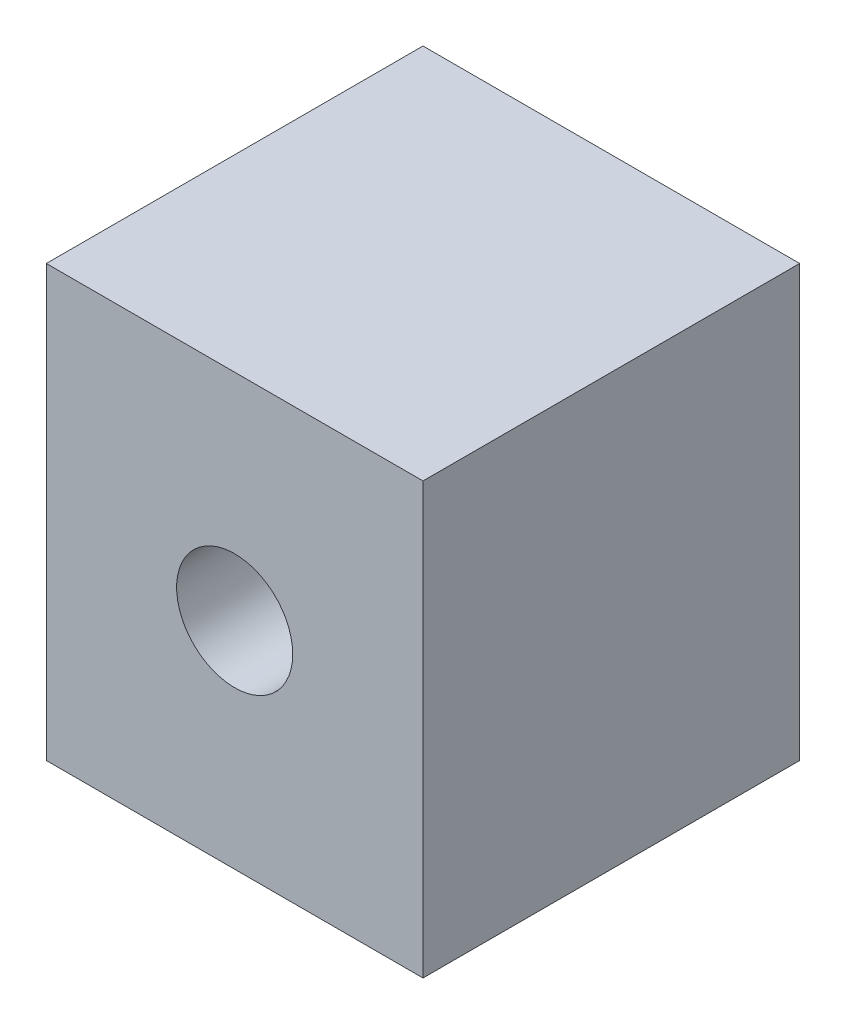
ISO-10303-21;
HEADER;
FILE_DESCRIPTION(('STEP AP214'),'2;1');
FILE_NAME('part.step','',(''),(''),'','','');
FILE_SCHEMA(('AUTOMOTIVE_DESIGN { 1 0 10303 214 1 1 1 1 }'));
ENDSEC;
DATA;
#1=APPLICATION_CONTEXT('core data for automotive mechanical design processes');
#2=APPLICATION_PROTOCOL_DEFINITION('international standard','automotive_design',2000,#1);
#3=PRODUCT_CONTEXT('',#1,'mechanical');
#4=PRODUCT('Part','Part','',(#3));
#5=PRODUCT_RELATED_PRODUCT_CATEGORY('part','',(#4));
#6=PRODUCT_DEFINITION_FORMATION('','',#4);
#7=PRODUCT_DEFINITION_CONTEXT('part definition',#1,'design');
#8=PRODUCT_DEFINITION('design','',#6,#7);
#9=PRODUCT_DEFINITION_SHAPE('','',#8);
#10=(LENGTH_UNIT() NAMED_UNIT(*) SI_UNIT(.MILLI.,.METRE.));
#11=(NAMED_UNIT(*) PLANE_ANGLE_UNIT() SI_UNIT($,.RADIAN.));
#12=(NAMED_UNIT(*) SI_UNIT($,.STERADIAN.) SOLID_ANGLE_UNIT());
#13=UNCERTAINTY_MEASURE_WITH_UNIT(LENGTH_MEASURE(1.E-05),#10,'distance_accuracy_value','');
#14=(GEOMETRIC_REPRESENTATION_CONTEXT(3) GLOBAL_UNCERTAINTY_ASSIGNED_CONTEXT((#13)) GLOBAL_UNIT_ASSIGNED_CONTEXT((#10,
#11,#12)) REPRESENTATION_CONTEXT('',''));
#15=CARTESIAN_POINT('',(0.,0.,0.));
#16=DIRECTION('',(0.,0.,1.));
#17=DIRECTION('',(1.,0.,0.));
#18=AXIS2_PLACEMENT_3D('',#15,#16,#17);
#19=CARTESIAN_POINT('',(0.,50.8,0.));
#20=DIRECTION('',(1.,0.,0.));
#21=DIRECTION('',(0.,0.,-1.));
#22=AXIS2_PLACEMENT_3D('',#19,#20,#21);
#23=PLANE('',#22);
#24=DIRECTION('',(0.,0.,1.));
#25=VECTOR('',#24,1.);
#26=CARTESIAN_POINT('',(0.,0.,0.));
#27=LINE('',#26,#25);
#28=CARTESIAN_POINT('',(0.,0.,0.));
#29=VERTEX_POINT('',#28);
#30=CARTESIAN_POINT('',(0.,0.,44.45));
#31=VERTEX_POINT('',#30);
#32=EDGE_CURVE('E100',#29,#31,#27,.T.);
#33=ORIENTED_EDGE('',*,*,#32,.T.);
#34=DIRECTION('',(0.,-1.,0.));
#35=VECTOR('',#34,1.);
#36=CARTESIAN_POINT('',(0.,50.8,44.45));
#37=LINE('',#36,#35);
#38=CARTESIAN_POINT('',(0.,50.8,44.45));
#39=VERTEX_POINT('',#38);
#40=EDGE_CURVE('E11',#39,#31,#37,.T.);
#41=ORIENTED_EDGE('',*,*,#40,.F.);
#42=DIRECTION('',(0.,0.,1.));
#43=VECTOR('',#42,1.);
#44=CARTESIAN_POINT('',(0.,50.8,0.));
#45=LINE('',#44,#43);
#46=CARTESIAN_POINT('',(0.,50.8,0.));
#47=VERTEX_POINT('',#46);
#48=EDGE_CURVE('E87',#47,#39,#45,.T.);
#49=ORIENTED_EDGE('',*,*,#48,.F.);
#50=DIRECTION('',(0.,-1.,0.));
#51=VECTOR('',#50,1.);
#52=CARTESIAN_POINT('',(0.,50.8,0.));
#53=LINE('',#52,#51);
#54=EDGE_CURVE('E96',#47,#29,#53,.T.);
#55=ORIENTED_EDGE('',*,*,#54,.T.);
#56=EDGE_LOOP('',(#33,#41,#49,#55));
#57=FACE_BOUND('',#56,.T.);
#58=ADVANCED_FACE('F35',(#57),#23,.F.);
#59=CARTESIAN_POINT('',(0.,50.8,44.45));
#60=DIRECTION('',(0.,0.,-1.));
#61=DIRECTION('',(-1.,0.,0.));
#62=AXIS2_PLACEMENT_3D('',#59,#60,#61);
#63=PLANE('',#62);
#64=CARTESIAN_POINT('',(22.225,25.4,44.45));
#65=DIRECTION('',(0.,0.,1.));
#66=DIRECTION('',(1.,0.,0.));
#67=AXIS2_PLACEMENT_3D('',#64,#65,#66);
#68=CIRCLE('',#67,6.849999);
#69=CARTESIAN_POINT('',(29.074999,25.4,44.45));
#70=VERTEX_POINT('',#69);
#71=EDGE_CURVE('E113',#70,#70,#68,.T.);
#72=ORIENTED_EDGE('',*,*,#71,.F.);
#73=EDGE_LOOP('',(#72));
#74=FACE_BOUND('',#73,.T.);
#75=DIRECTION('',(1.,0.,0.));
#76=VECTOR('',#75,1.);
#77=CARTESIAN_POINT('',(0.,0.,44.45));
#78=LINE('',#77,#76);
#79=CARTESIAN_POINT('',(44.45,0.,44.45));
#80=VERTEX_POINT('',#79);
#81=EDGE_CURVE('E91',#31,#80,#78,.T.);
#82=ORIENTED_EDGE('',*,*,#81,.T.);
#83=DIRECTION('',(0.,-1.,0.));
#84=VECTOR('',#83,1.);
#85=CARTESIAN_POINT('',(44.45,50.8,44.45));
#86=LINE('',#85,#84);
#87=CARTESIAN_POINT('',(44.45,50.8,44.45));
#88=VERTEX_POINT('',#87);
#89=EDGE_CURVE('E44',#88,#80,#86,.T.);
#90=ORIENTED_EDGE('',*,*,#89,.F.);
#91=DIRECTION('',(1.,0.,0.));
#92=VECTOR('',#91,1.);
#93=CARTESIAN_POINT('',(0.,50.8,44.45));
#94=LINE('',#93,#92);
#95=EDGE_CURVE('E82',#39,#88,#94,.T.);
#96=ORIENTED_EDGE('',*,*,#95,.F.);
#97=ORIENTED_EDGE('',*,*,#40,.T.);
#98=EDGE_LOOP('',(#82,#90,#96,#97));
#99=FACE_BOUND('',#98,.T.);
#100=ADVANCED_FACE('F90',(#74,#99),#63,.F.);
#101=CARTESIAN_POINT('',(44.45,50.8,0.));
#102=DIRECTION('',(-1.,0.,0.));
#103=DIRECTION('',(0.,0.,1.));
#104=AXIS2_PLACEMENT_3D('',#101,#102,#103);
#105=PLANE('',#104);
#106=DIRECTION('',(0.,0.,-1.));
#107=VECTOR('',#106,1.);
#108=CARTESIAN_POINT('',(44.45,0.,0.));
#109=LINE('',#108,#107);
#110=CARTESIAN_POINT('',(44.45,0.,0.));
#111=VERTEX_POINT('',#110);
#112=EDGE_CURVE('E69',#80,#111,#109,.T.);
#113=ORIENTED_EDGE('',*,*,#112,.T.);
#114=DIRECTION('',(0.,-1.,0.));
#115=VECTOR('',#114,1.);
#116=CARTESIAN_POINT('',(44.45,50.8,0.));
#117=LINE('',#116,#115);
#118=CARTESIAN_POINT('',(44.45,50.8,0.));
#119=VERTEX_POINT('',#118);
#120=EDGE_CURVE('E92',#119,#111,#117,.T.);
#121=ORIENTED_EDGE('',*,*,#120,.F.);
#122=DIRECTION('',(0.,0.,-1.));
#123=VECTOR('',#122,1.);
#124=CARTESIAN_POINT('',(44.45,50.8,0.));
#125=LINE('',#124,#123);
#126=EDGE_CURVE('E85',#88,#119,#125,.T.);
#127=ORIENTED_EDGE('',*,*,#126,.F.);
#128=ORIENTED_EDGE('',*,*,#89,.T.);
#129=EDGE_LOOP('',(#113,#121,#127,#128));
#130=FACE_BOUND('',#129,.T.);
#131=ADVANCED_FACE('F94',(#130),#105,.F.);
#132=CARTESIAN_POINT('',(0.,50.8,0.));
#133=DIRECTION('',(0.,0.,1.));
#134=DIRECTION('',(1.,0.,0.));
#135=AXIS2_PLACEMENT_3D('',#132,#133,#134);
#136=PLANE('',#135);
#137=CARTESIAN_POINT('',(22.225,25.4,0.));
#138=DIRECTION('',(0.,0.,1.));
#139=DIRECTION('',(1.,0.,0.));
#140=AXIS2_PLACEMENT_3D('',#137,#138,#139);
#141=CIRCLE('',#140,6.849999);
#142=CARTESIAN_POINT('',(29.074999,25.4,0.));
#143=VERTEX_POINT('',#142);
#144=EDGE_CURVE('E38',#143,#143,#141,.T.);
#145=ORIENTED_EDGE('',*,*,#144,.T.);
#146=EDGE_LOOP('',(#145));
#147=FACE_BOUND('',#146,.T.);
#148=DIRECTION('',(-1.,0.,0.));
#149=VECTOR('',#148,1.);
#150=CARTESIAN_POINT('',(0.,0.,0.));
#151=LINE('',#150,#149);
#152=EDGE_CURVE('E75',#111,#29,#151,.T.);
#153=ORIENTED_EDGE('',*,*,#152,.T.);
#154=ORIENTED_EDGE('',*,*,#54,.F.);
#155=DIRECTION('',(-1.,0.,0.));
#156=VECTOR('',#155,1.);
#157=CARTESIAN_POINT('',(0.,50.8,0.));
#158=LINE('',#157,#156);
#159=EDGE_CURVE('E52',#119,#47,#158,.T.);
#160=ORIENTED_EDGE('',*,*,#159,.F.);
#161=ORIENTED_EDGE('',*,*,#120,.T.);
#162=EDGE_LOOP('',(#153,#154,#160,#161));
#163=FACE_BOUND('',#162,.T.);
#164=ADVANCED_FACE('F107',(#147,#163),#136,.F.);
#165=CARTESIAN_POINT('',(0.,50.8,0.));
#166=DIRECTION('',(0.,1.,0.));
#167=DIRECTION('',(0.,0.,1.));
#168=AXIS2_PLACEMENT_3D('',#165,#166,#167);
#169=PLANE('',#168);
#170=ORIENTED_EDGE('',*,*,#48,.T.);
#171=ORIENTED_EDGE('',*,*,#95,.T.);
#172=ORIENTED_EDGE('',*,*,#126,.T.);
#173=ORIENTED_EDGE('',*,*,#159,.T.);
#174=EDGE_LOOP('',(#170,#171,#172,#173));
#175=FACE_BOUND('',#174,.T.);
#176=ADVANCED_FACE('F83',(#175),#169,.T.);
#177=CARTESIAN_POINT('',(0.,0.,0.));
#178=DIRECTION('',(0.,1.,0.));
#179=DIRECTION('',(0.,0.,1.));
#180=AXIS2_PLACEMENT_3D('',#177,#178,#179);
#181=PLANE('',#180);
#182=CARTESIAN_POINT('',(33.401,0.,22.225));
#183=DIRECTION('',(0.,-1.,0.));
#184=DIRECTION('',(0.,0.,-1.));
#185=AXIS2_PLACEMENT_3D('',#182,#183,#184);
#186=CIRCLE('',#185,3.674999);
#187=CARTESIAN_POINT('',(33.401,0.,18.550001));
#188=VERTEX_POINT('',#187);
#189=EDGE_CURVE('E123',#188,#188,#186,.T.);
#190=ORIENTED_EDGE('',*,*,#189,.F.);
#191=EDGE_LOOP('',(#190));
#192=FACE_BOUND('',#191,.T.);
#193=CARTESIAN_POINT('',(11.0818452898828,0.,22.225));
#194=DIRECTION('',(0.,-1.,0.));
#195=DIRECTION('',(0.,0.,-1.));
#196=AXIS2_PLACEMENT_3D('',#193,#194,#195);
#197=CIRCLE('',#196,3.674999);
#198=CARTESIAN_POINT('',(11.0818452898828,0.,18.550001));
#199=VERTEX_POINT('',#198);
#200=EDGE_CURVE('E117',#199,#199,#197,.T.);
#201=ORIENTED_EDGE('',*,*,#200,.F.);
#202=EDGE_LOOP('',(#201));
#203=FACE_BOUND('',#202,.T.);
#204=ORIENTED_EDGE('',*,*,#32,.F.);
#205=ORIENTED_EDGE('',*,*,#152,.F.);
#206=ORIENTED_EDGE('',*,*,#112,.F.);
#207=ORIENTED_EDGE('',*,*,#81,.F.);
#208=EDGE_LOOP('',(#204,#205,#206,#207));
#209=FACE_BOUND('',#208,.T.);
#210=ADVANCED_FACE('F110',(#192,#203,#209),#181,.F.);
#211=CARTESIAN_POINT('',(22.225,25.4,-6.35));
#212=DIRECTION('',(0.,0.,1.));
#213=DIRECTION('',(1.,0.,0.));
#214=AXIS2_PLACEMENT_3D('',#211,#212,#213);
#215=CYLINDRICAL_SURFACE('',#214,6.849999);
#216=ORIENTED_EDGE('',*,*,#71,.T.);
#217=EDGE_LOOP('',(#216));
#218=FACE_BOUND('',#217,.T.);
#219=ORIENTED_EDGE('',*,*,#144,.F.);
#220=EDGE_LOOP('',(#219));
#221=FACE_BOUND('',#220,.T.);
#222=ADVANCED_FACE('F140',(#218,#221),#215,.F.);
#223=CARTESIAN_POINT('',(11.0818452898828,6.35,22.225));
#224=DIRECTION('',(0.,-1.,0.));
#225=DIRECTION('',(0.,0.,-1.));
#226=AXIS2_PLACEMENT_3D('',#223,#224,#225);
#227=CYLINDRICAL_SURFACE('',#226,3.674999);
#228=CARTESIAN_POINT('',(11.0818452898828,6.35,22.225));
#229=DIRECTION('',(0.,-1.,0.));
#230=DIRECTION('',(0.,0.,-1.));
#231=AXIS2_PLACEMENT_3D('',#228,#229,#230);
#232=CIRCLE('',#231,3.674999);
#233=CARTESIAN_POINT('',(11.0818452898828,6.35,18.550001));
#234=VERTEX_POINT('',#233);
#235=EDGE_CURVE('E116',#234,#234,#232,.T.);
#236=ORIENTED_EDGE('',*,*,#235,.F.);
#237=EDGE_LOOP('',(#236));
#238=FACE_BOUND('',#237,.T.);
#239=ORIENTED_EDGE('',*,*,#200,.T.);
#240=EDGE_LOOP('',(#239));
#241=FACE_BOUND('',#240,.T.);
#242=ADVANCED_FACE('F144',(#238,#241),#227,.F.);
#243=CARTESIAN_POINT('',(11.0818452898828,6.35,22.225));
#244=DIRECTION('',(0.,-1.,0.));
#245=DIRECTION('',(0.,0.,-1.));
#246=AXIS2_PLACEMENT_3D('',#243,#244,#245);
#247=PLANE('',#246);
#248=ORIENTED_EDGE('',*,*,#235,.T.);
#249=EDGE_LOOP('',(#248));
#250=FACE_BOUND('',#249,.T.);
#251=ADVANCED_FACE('F134',(#250),#247,.T.);
#252=CARTESIAN_POINT('',(33.401,6.35,22.225));
#253=DIRECTION('',(0.,-1.,0.));
#254=DIRECTION('',(0.,0.,-1.));
#255=AXIS2_PLACEMENT_3D('',#252,#253,#254);
#256=CYLINDRICAL_SURFACE('',#255,3.674999);
#257=CARTESIAN_POINT('',(33.401,6.35,22.225));
#258=DIRECTION('',(0.,-1.,0.));
#259=DIRECTION('',(0.,0.,-1.));
#260=AXIS2_PLACEMENT_3D('',#257,#258,#259);
#261=CIRCLE('',#260,3.674999);
#262=CARTESIAN_POINT('',(33.401,6.35,18.550001));
#263=VERTEX_POINT('',#262);
#264=EDGE_CURVE('E120',#263,#263,#261,.T.);
#265=ORIENTED_EDGE('',*,*,#264,.F.);
#266=EDGE_LOOP('',(#265));
#267=FACE_BOUND('',#266,.T.);
#268=ORIENTED_EDGE('',*,*,#189,.T.);
#269=EDGE_LOOP('',(#268));
#270=FACE_BOUND('',#269,.T.);
#271=ADVANCED_FACE('F131',(#267,#270),#256,.F.);
#272=CARTESIAN_POINT('',(33.401,6.35,22.225));
#273=DIRECTION('',(0.,-1.,0.));
#274=DIRECTION('',(0.,0.,-1.));
#275=AXIS2_PLACEMENT_3D('',#272,#273,#274);
#276=PLANE('',#275);
#277=ORIENTED_EDGE('',*,*,#264,.T.);
#278=EDGE_LOOP('',(#277));
#279=FACE_BOUND('',#278,.T.);
#280=ADVANCED_FACE('F129',(#279),#276,.T.);
#281=CLOSED_SHELL('',(#58,#100,#131,#164,#176,#210,#222,#242,#251,#271,#280));
#282=MANIFOLD_SOLID_BREP('B2',#281);
#283=ADVANCED_BREP_SHAPE_REPRESENTATION('',(#18,#282),#14);
#284=SHAPE_DEFINITION_REPRESENTATION(#9,#283);
ENDSEC;
END-ISO-10303-21;
